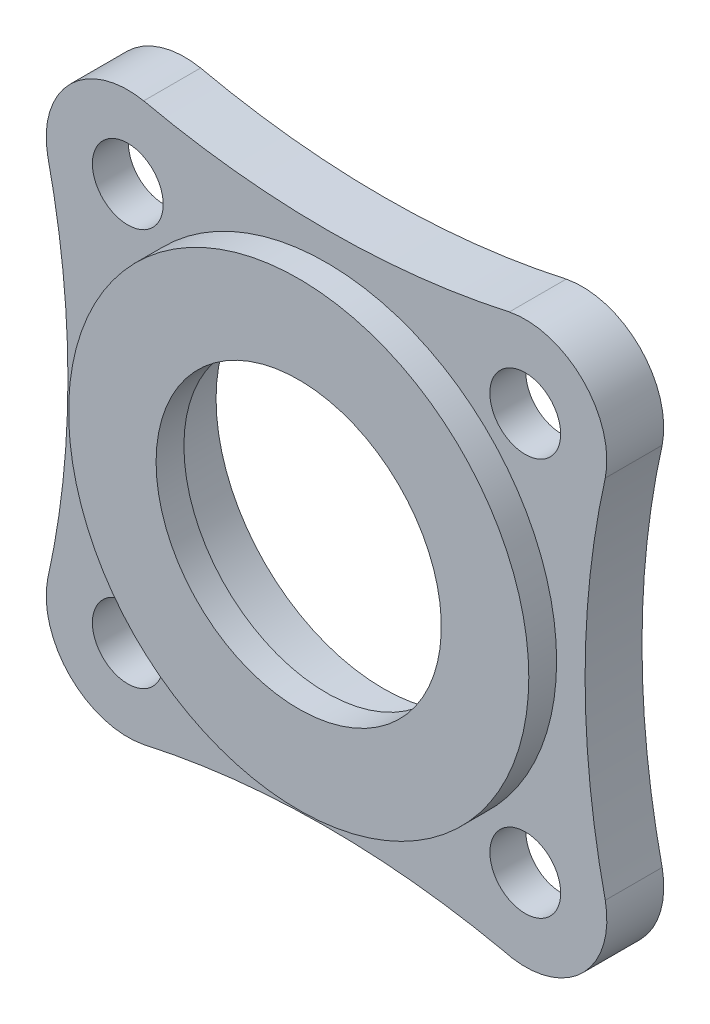
ISO-10303-21;
HEADER;
FILE_DESCRIPTION(('STEP AP214'),'2;1');
FILE_NAME('part.step','',(''),(''),'','','');
FILE_SCHEMA(('AUTOMOTIVE_DESIGN { 1 0 10303 214 1 1 1 1 }'));
ENDSEC;
DATA;
#1=APPLICATION_CONTEXT('core data for automotive mechanical design processes');
#2=APPLICATION_PROTOCOL_DEFINITION('international standard','automotive_design',2000,#1);
#3=PRODUCT_CONTEXT('',#1,'mechanical');
#4=PRODUCT('Part','Part','',(#3));
#5=PRODUCT_RELATED_PRODUCT_CATEGORY('part','',(#4));
#6=PRODUCT_DEFINITION_FORMATION('','',#4);
#7=PRODUCT_DEFINITION_CONTEXT('part definition',#1,'design');
#8=PRODUCT_DEFINITION('design','',#6,#7);
#9=PRODUCT_DEFINITION_SHAPE('','',#8);
#10=(LENGTH_UNIT() NAMED_UNIT(*) SI_UNIT(.MILLI.,.METRE.));
#11=(NAMED_UNIT(*) PLANE_ANGLE_UNIT() SI_UNIT($,.RADIAN.));
#12=(NAMED_UNIT(*) SI_UNIT($,.STERADIAN.) SOLID_ANGLE_UNIT());
#13=UNCERTAINTY_MEASURE_WITH_UNIT(LENGTH_MEASURE(1.E-05),#10,'distance_accuracy_value','');
#14=(GEOMETRIC_REPRESENTATION_CONTEXT(3) GLOBAL_UNCERTAINTY_ASSIGNED_CONTEXT((#13)) GLOBAL_UNIT_ASSIGNED_CONTEXT((#10,
#11,#12)) REPRESENTATION_CONTEXT('',''));
#15=CARTESIAN_POINT('',(0.,0.,0.));
#16=DIRECTION('',(0.,0.,1.));
#17=DIRECTION('',(1.,0.,0.));
#18=AXIS2_PLACEMENT_3D('',#15,#16,#17);
#19=CARTESIAN_POINT('',(18.9999780967866,19.0000219031894,5.44));
#20=DIRECTION('',(0.,0.,-1.));
#21=DIRECTION('',(-1.,0.,0.));
#22=AXIS2_PLACEMENT_3D('',#19,#20,#21);
#23=CYLINDRICAL_SURFACE('',#22,3.385);
#24=CARTESIAN_POINT('',(18.9999780967866,19.0000219031894,5.44));
#25=DIRECTION('',(0.,0.,1.));
#26=DIRECTION('',(1.,0.,0.));
#27=AXIS2_PLACEMENT_3D('',#24,#25,#26);
#28=CIRCLE('',#27,3.385);
#29=CARTESIAN_POINT('',(22.3849780967866,19.0000219031894,5.44));
#30=VERTEX_POINT('',#29);
#31=EDGE_CURVE('E146',#30,#30,#28,.T.);
#32=ORIENTED_EDGE('',*,*,#31,.T.);
#33=EDGE_LOOP('',(#32));
#34=FACE_BOUND('',#33,.T.);
#35=CARTESIAN_POINT('',(18.9999780967866,19.0000219031894,2.));
#36=DIRECTION('',(0.,0.,-1.));
#37=DIRECTION('',(-1.,0.,0.));
#38=AXIS2_PLACEMENT_3D('',#35,#36,#37);
#39=CIRCLE('',#38,3.385);
#40=CARTESIAN_POINT('',(15.6149780967866,19.0000219031894,2.));
#41=VERTEX_POINT('',#40);
#42=EDGE_CURVE('E43',#41,#41,#39,.T.);
#43=ORIENTED_EDGE('',*,*,#42,.T.);
#44=EDGE_LOOP('',(#43));
#45=FACE_BOUND('',#44,.T.);
#46=ADVANCED_FACE('F39',(#34,#45),#23,.F.);
#47=CARTESIAN_POINT('',(-19.0000219031881,18.9999780967864,5.44));
#48=DIRECTION('',(0.,0.,-1.));
#49=DIRECTION('',(-1.,0.,0.));
#50=AXIS2_PLACEMENT_3D('',#47,#48,#49);
#51=CYLINDRICAL_SURFACE('',#50,3.385);
#52=CARTESIAN_POINT('',(-19.0000219031881,18.9999780967864,5.44));
#53=DIRECTION('',(0.,0.,1.));
#54=DIRECTION('',(1.,0.,0.));
#55=AXIS2_PLACEMENT_3D('',#52,#53,#54);
#56=CIRCLE('',#55,3.385);
#57=CARTESIAN_POINT('',(-15.6150219031881,18.9999780967864,5.44));
#58=VERTEX_POINT('',#57);
#59=EDGE_CURVE('E143',#58,#58,#56,.T.);
#60=ORIENTED_EDGE('',*,*,#59,.T.);
#61=EDGE_LOOP('',(#60));
#62=FACE_BOUND('',#61,.T.);
#63=CARTESIAN_POINT('',(-19.0000219031881,18.9999780967864,2.));
#64=DIRECTION('',(0.,0.,-1.));
#65=DIRECTION('',(-1.,0.,0.));
#66=AXIS2_PLACEMENT_3D('',#63,#64,#65);
#67=CIRCLE('',#66,3.385);
#68=CARTESIAN_POINT('',(-22.3850219031881,18.9999780967864,2.));
#69=VERTEX_POINT('',#68);
#70=EDGE_CURVE('E194',#69,#69,#67,.T.);
#71=ORIENTED_EDGE('',*,*,#70,.T.);
#72=EDGE_LOOP('',(#71));
#73=FACE_BOUND('',#72,.T.);
#74=ADVANCED_FACE('F256',(#62,#73),#51,.F.);
#75=CARTESIAN_POINT('',(-18.9999780967851,-19.0000219031884,5.44));
#76=DIRECTION('',(0.,0.,-1.));
#77=DIRECTION('',(-1.,0.,0.));
#78=AXIS2_PLACEMENT_3D('',#75,#76,#77);
#79=CYLINDRICAL_SURFACE('',#78,3.385);
#80=CARTESIAN_POINT('',(-18.9999780967851,-19.0000219031884,5.44));
#81=DIRECTION('',(0.,0.,1.));
#82=DIRECTION('',(1.,0.,0.));
#83=AXIS2_PLACEMENT_3D('',#80,#81,#82);
#84=CIRCLE('',#83,3.385);
#85=CARTESIAN_POINT('',(-15.6149780967851,-19.0000219031884,5.44));
#86=VERTEX_POINT('',#85);
#87=EDGE_CURVE('E140',#86,#86,#84,.T.);
#88=ORIENTED_EDGE('',*,*,#87,.T.);
#89=EDGE_LOOP('',(#88));
#90=FACE_BOUND('',#89,.T.);
#91=CARTESIAN_POINT('',(-18.9999780967851,-19.0000219031884,2.));
#92=DIRECTION('',(0.,0.,-1.));
#93=DIRECTION('',(-1.,0.,0.));
#94=AXIS2_PLACEMENT_3D('',#91,#92,#93);
#95=CIRCLE('',#94,3.385);
#96=CARTESIAN_POINT('',(-22.3849780967851,-19.0000219031884,2.));
#97=VERTEX_POINT('',#96);
#98=EDGE_CURVE('E191',#97,#97,#95,.T.);
#99=ORIENTED_EDGE('',*,*,#98,.T.);
#100=EDGE_LOOP('',(#99));
#101=FACE_BOUND('',#100,.T.);
#102=ADVANCED_FACE('F262',(#90,#101),#79,.F.);
#103=CARTESIAN_POINT('',(19.0035218007627,-19.0174586367365,5.44));
#104=DIRECTION('',(0.,0.,-1.));
#105=DIRECTION('',(-1.,0.,0.));
#106=AXIS2_PLACEMENT_3D('',#103,#104,#105);
#107=CYLINDRICAL_SURFACE('',#106,3.385);
#108=CARTESIAN_POINT('',(19.0035218007627,-19.0174586367365,5.44));
#109=DIRECTION('',(0.,0.,1.));
#110=DIRECTION('',(1.,0.,0.));
#111=AXIS2_PLACEMENT_3D('',#108,#109,#110);
#112=CIRCLE('',#111,3.385);
#113=CARTESIAN_POINT('',(22.3885218007627,-19.0174586367365,5.44));
#114=VERTEX_POINT('',#113);
#115=EDGE_CURVE('E134',#114,#114,#112,.T.);
#116=ORIENTED_EDGE('',*,*,#115,.T.);
#117=EDGE_LOOP('',(#116));
#118=FACE_BOUND('',#117,.T.);
#119=CARTESIAN_POINT('',(19.0035218007627,-19.0174586367365,2.));
#120=DIRECTION('',(0.,0.,-1.));
#121=DIRECTION('',(-1.,0.,0.));
#122=AXIS2_PLACEMENT_3D('',#119,#120,#121);
#123=CIRCLE('',#122,3.385);
#124=CARTESIAN_POINT('',(15.6185218007627,-19.0174586367365,2.));
#125=VERTEX_POINT('',#124);
#126=EDGE_CURVE('E188',#125,#125,#123,.T.);
#127=ORIENTED_EDGE('',*,*,#126,.T.);
#128=EDGE_LOOP('',(#127));
#129=FACE_BOUND('',#128,.T.);
#130=ADVANCED_FACE('F271',(#118,#129),#107,.F.);
#131=CARTESIAN_POINT('',(0.000213605920601893,-104.922401044392,5.44));
#132=DIRECTION('',(0.,0.,-1.));
#133=DIRECTION('',(-1.,0.,0.));
#134=AXIS2_PLACEMENT_3D('',#131,#132,#133);
#135=CYLINDRICAL_SURFACE('',#134,80.2);
#136=CARTESIAN_POINT('',(0.000213605920601893,-104.922401044392,0.));
#137=DIRECTION('',(0.,0.,1.));
#138=DIRECTION('',(1.,0.,0.));
#139=AXIS2_PLACEMENT_3D('',#136,#137,#138);
#140=CIRCLE('',#139,80.2);
#141=CARTESIAN_POINT('',(16.8250039112033,-26.5070554085841,0.));
#142=VERTEX_POINT('',#141);
#143=CARTESIAN_POINT('',(-17.4774192715566,-26.6499771072219,0.));
#144=VERTEX_POINT('',#143);
#145=EDGE_CURVE('E154',#142,#144,#140,.T.);
#146=ORIENTED_EDGE('',*,*,#145,.F.);
#147=DIRECTION('',(0.,0.,-1.));
#148=VECTOR('',#147,1.);
#149=CARTESIAN_POINT('',(16.8250039112033,-26.5070554085841,5.44));
#150=LINE('',#149,#148);
#151=CARTESIAN_POINT('',(16.8250039112033,-26.5070554085841,5.44));
#152=VERTEX_POINT('',#151);
#153=EDGE_CURVE('E49',#152,#142,#150,.T.);
#154=ORIENTED_EDGE('',*,*,#153,.F.);
#155=CARTESIAN_POINT('',(0.000213605920601893,-104.922401044392,5.44));
#156=DIRECTION('',(0.,0.,1.));
#157=DIRECTION('',(1.,0.,0.));
#158=AXIS2_PLACEMENT_3D('',#155,#156,#157);
#159=CIRCLE('',#158,80.2);
#160=CARTESIAN_POINT('',(-17.4774192715566,-26.6499771072219,5.44));
#161=VERTEX_POINT('',#160);
#162=EDGE_CURVE('E177',#152,#161,#159,.T.);
#163=ORIENTED_EDGE('',*,*,#162,.T.);
#164=DIRECTION('',(0.,0.,-1.));
#165=VECTOR('',#164,1.);
#166=CARTESIAN_POINT('',(-17.4774192715566,-26.6499771072219,5.44));
#167=LINE('',#166,#165);
#168=EDGE_CURVE('E93',#161,#144,#167,.T.);
#169=ORIENTED_EDGE('',*,*,#168,.T.);
#170=EDGE_LOOP('',(#146,#154,#163,#169));
#171=FACE_BOUND('',#170,.T.);
#172=ADVANCED_FACE('F41',(#171),#135,.F.);
#173=CARTESIAN_POINT('',(19.0035218007627,-19.0174586367365,5.44));
#174=DIRECTION('',(0.,0.,-1.));
#175=DIRECTION('',(-1.,0.,0.));
#176=AXIS2_PLACEMENT_3D('',#173,#174,#175);
#177=CYLINDRICAL_SURFACE('',#176,7.8);
#178=CARTESIAN_POINT('',(19.0035218007627,-19.0174586367365,0.));
#179=DIRECTION('',(0.,0.,1.));
#180=DIRECTION('',(1.,0.,0.));
#181=AXIS2_PLACEMENT_3D('',#178,#179,#180);
#182=CIRCLE('',#181,7.8);
#183=CARTESIAN_POINT('',(26.6499771072231,-17.477419271557,0.));
#184=VERTEX_POINT('',#183);
#185=EDGE_CURVE('E157',#142,#184,#182,.T.);
#186=ORIENTED_EDGE('',*,*,#185,.T.);
#187=DIRECTION('',(0.,0.,-1.));
#188=VECTOR('',#187,1.);
#189=CARTESIAN_POINT('',(26.6499771072231,-17.477419271557,5.44));
#190=LINE('',#189,#188);
#191=CARTESIAN_POINT('',(26.6499771072231,-17.477419271557,5.44));
#192=VERTEX_POINT('',#191);
#193=EDGE_CURVE('E185',#192,#184,#190,.T.);
#194=ORIENTED_EDGE('',*,*,#193,.F.);
#195=CARTESIAN_POINT('',(19.0035218007627,-19.0174586367365,5.44));
#196=DIRECTION('',(0.,0.,1.));
#197=DIRECTION('',(1.,0.,0.));
#198=AXIS2_PLACEMENT_3D('',#195,#196,#197);
#199=CIRCLE('',#198,7.8);
#200=EDGE_CURVE('E221',#152,#192,#199,.T.);
#201=ORIENTED_EDGE('',*,*,#200,.F.);
#202=ORIENTED_EDGE('',*,*,#153,.T.);
#203=EDGE_LOOP('',(#186,#194,#201,#202));
#204=FACE_BOUND('',#203,.T.);
#205=ADVANCED_FACE('F240',(#204),#177,.T.);
#206=CARTESIAN_POINT('',(104.922401044394,0.000213605920345668,5.44));
#207=DIRECTION('',(0.,0.,-1.));
#208=DIRECTION('',(-1.,0.,0.));
#209=AXIS2_PLACEMENT_3D('',#206,#207,#208);
#210=CYLINDRICAL_SURFACE('',#209,80.2);
#211=CARTESIAN_POINT('',(104.922401044394,0.000213605920345668,0.));
#212=DIRECTION('',(0.,0.,1.));
#213=DIRECTION('',(1.,0.,0.));
#214=AXIS2_PLACEMENT_3D('',#211,#212,#213);
#215=CIRCLE('',#214,80.2);
#216=CARTESIAN_POINT('',(26.6502742791419,17.4791772950063,0.));
#217=VERTEX_POINT('',#216);
#218=EDGE_CURVE('E160',#217,#184,#215,.T.);
#219=ORIENTED_EDGE('',*,*,#218,.F.);
#220=DIRECTION('',(0.,0.,-1.));
#221=VECTOR('',#220,1.);
#222=CARTESIAN_POINT('',(26.6502742791419,17.4791772950063,5.44));
#223=LINE('',#222,#221);
#224=CARTESIAN_POINT('',(26.6502742791419,17.4791772950063,5.44));
#225=VERTEX_POINT('',#224);
#226=EDGE_CURVE('E183',#225,#217,#223,.T.);
#227=ORIENTED_EDGE('',*,*,#226,.F.);
#228=CARTESIAN_POINT('',(104.922401044394,0.000213605920345668,5.44));
#229=DIRECTION('',(0.,0.,1.));
#230=DIRECTION('',(1.,0.,0.));
#231=AXIS2_PLACEMENT_3D('',#228,#229,#230);
#232=CIRCLE('',#231,80.2);
#233=EDGE_CURVE('E223',#225,#192,#232,.T.);
#234=ORIENTED_EDGE('',*,*,#233,.T.);
#235=ORIENTED_EDGE('',*,*,#193,.T.);
#236=EDGE_LOOP('',(#219,#227,#234,#235));
#237=FACE_BOUND('',#236,.T.);
#238=ADVANCED_FACE('F243',(#237),#210,.F.);
#239=CARTESIAN_POINT('',(18.9999780967866,19.0000219031894,5.44));
#240=DIRECTION('',(0.,0.,-1.));
#241=DIRECTION('',(-1.,0.,0.));
#242=AXIS2_PLACEMENT_3D('',#239,#240,#241);
#243=CYLINDRICAL_SURFACE('',#242,7.8);
#244=CARTESIAN_POINT('',(18.9999780967866,19.0000219031894,0.));
#245=DIRECTION('',(0.,0.,1.));
#246=DIRECTION('',(1.,0.,0.));
#247=AXIS2_PLACEMENT_3D('',#244,#245,#246);
#248=CIRCLE('',#247,7.8);
#249=CARTESIAN_POINT('',(17.4774192715582,26.6499771072229,0.));
#250=VERTEX_POINT('',#249);
#251=EDGE_CURVE('E163',#217,#250,#248,.T.);
#252=ORIENTED_EDGE('',*,*,#251,.T.);
#253=DIRECTION('',(0.,0.,-1.));
#254=VECTOR('',#253,1.);
#255=CARTESIAN_POINT('',(17.4774192715582,26.6499771072229,5.44));
#256=LINE('',#255,#254);
#257=CARTESIAN_POINT('',(17.4774192715582,26.6499771072229,5.44));
#258=VERTEX_POINT('',#257);
#259=EDGE_CURVE('E181',#258,#250,#256,.T.);
#260=ORIENTED_EDGE('',*,*,#259,.F.);
#261=CARTESIAN_POINT('',(18.9999780967866,19.0000219031894,5.44));
#262=DIRECTION('',(0.,0.,1.));
#263=DIRECTION('',(1.,0.,0.));
#264=AXIS2_PLACEMENT_3D('',#261,#262,#263);
#265=CIRCLE('',#264,7.8);
#266=EDGE_CURVE('E226',#225,#258,#265,.T.);
#267=ORIENTED_EDGE('',*,*,#266,.F.);
#268=ORIENTED_EDGE('',*,*,#226,.T.);
#269=EDGE_LOOP('',(#252,#260,#267,#268));
#270=FACE_BOUND('',#269,.T.);
#271=ADVANCED_FACE('F246',(#270),#243,.T.);
#272=CARTESIAN_POINT('',(-0.000213605919076365,104.922401044393,5.44));
#273=DIRECTION('',(0.,0.,-1.));
#274=DIRECTION('',(-1.,0.,0.));
#275=AXIS2_PLACEMENT_3D('',#272,#273,#274);
#276=CYLINDRICAL_SURFACE('',#275,80.2);
#277=CARTESIAN_POINT('',(-0.000213605919076365,104.922401044393,0.));
#278=DIRECTION('',(0.,0.,1.));
#279=DIRECTION('',(1.,0.,0.));
#280=AXIS2_PLACEMENT_3D('',#277,#278,#279);
#281=CIRCLE('',#280,80.2);
#282=CARTESIAN_POINT('',(-17.4791772950052,26.6502742791417,0.));
#283=VERTEX_POINT('',#282);
#284=EDGE_CURVE('E166',#283,#250,#281,.T.);
#285=ORIENTED_EDGE('',*,*,#284,.F.);
#286=DIRECTION('',(0.,0.,-1.));
#287=VECTOR('',#286,1.);
#288=CARTESIAN_POINT('',(-17.4791772950052,26.6502742791417,5.44));
#289=LINE('',#288,#287);
#290=CARTESIAN_POINT('',(-17.4791772950052,26.6502742791417,5.44));
#291=VERTEX_POINT('',#290);
#292=EDGE_CURVE('E130',#291,#283,#289,.T.);
#293=ORIENTED_EDGE('',*,*,#292,.F.);
#294=CARTESIAN_POINT('',(-0.000213605919076365,104.922401044393,5.44));
#295=DIRECTION('',(0.,0.,1.));
#296=DIRECTION('',(1.,0.,0.));
#297=AXIS2_PLACEMENT_3D('',#294,#295,#296);
#298=CIRCLE('',#297,80.2);
#299=EDGE_CURVE('E119',#291,#258,#298,.T.);
#300=ORIENTED_EDGE('',*,*,#299,.T.);
#301=ORIENTED_EDGE('',*,*,#259,.T.);
#302=EDGE_LOOP('',(#285,#293,#300,#301));
#303=FACE_BOUND('',#302,.T.);
#304=ADVANCED_FACE('F229',(#303),#276,.F.);
#305=CARTESIAN_POINT('',(-19.0000219031881,18.9999780967864,5.44));
#306=DIRECTION('',(0.,0.,-1.));
#307=DIRECTION('',(-1.,0.,0.));
#308=AXIS2_PLACEMENT_3D('',#305,#306,#307);
#309=CYLINDRICAL_SURFACE('',#308,7.8);
#310=CARTESIAN_POINT('',(-19.0000219031881,18.9999780967864,0.));
#311=DIRECTION('',(0.,0.,1.));
#312=DIRECTION('',(1.,0.,0.));
#313=AXIS2_PLACEMENT_3D('',#310,#311,#312);
#314=CIRCLE('',#313,7.8);
#315=CARTESIAN_POINT('',(-26.6499771072216,17.477419271558,0.));
#316=VERTEX_POINT('',#315);
#317=EDGE_CURVE('E126',#283,#316,#314,.T.);
#318=ORIENTED_EDGE('',*,*,#317,.T.);
#319=DIRECTION('',(0.,0.,-1.));
#320=VECTOR('',#319,1.);
#321=CARTESIAN_POINT('',(-26.6499771072216,17.477419271558,5.44));
#322=LINE('',#321,#320);
#323=CARTESIAN_POINT('',(-26.6499771072216,17.477419271558,5.44));
#324=VERTEX_POINT('',#323);
#325=EDGE_CURVE('E123',#324,#316,#322,.T.);
#326=ORIENTED_EDGE('',*,*,#325,.F.);
#327=CARTESIAN_POINT('',(-19.0000219031881,18.9999780967864,5.44));
#328=DIRECTION('',(0.,0.,1.));
#329=DIRECTION('',(1.,0.,0.));
#330=AXIS2_PLACEMENT_3D('',#327,#328,#329);
#331=CIRCLE('',#330,7.8);
#332=EDGE_CURVE('E112',#291,#324,#331,.T.);
#333=ORIENTED_EDGE('',*,*,#332,.F.);
#334=ORIENTED_EDGE('',*,*,#292,.T.);
#335=EDGE_LOOP('',(#318,#326,#333,#334));
#336=FACE_BOUND('',#335,.T.);
#337=ADVANCED_FACE('F124',(#336),#309,.T.);
#338=CARTESIAN_POINT('',(-104.922401044392,-0.000213605919345439,5.44));
#339=DIRECTION('',(0.,0.,-1.));
#340=DIRECTION('',(-1.,0.,0.));
#341=AXIS2_PLACEMENT_3D('',#338,#339,#340);
#342=CYLINDRICAL_SURFACE('',#341,80.2);
#343=CARTESIAN_POINT('',(-104.922401044392,-0.000213605919345439,0.));
#344=DIRECTION('',(0.,0.,1.));
#345=DIRECTION('',(1.,0.,0.));
#346=AXIS2_PLACEMENT_3D('',#343,#344,#345);
#347=CIRCLE('',#346,80.2);
#348=CARTESIAN_POINT('',(-26.6502742791404,-17.4791772950053,0.));
#349=VERTEX_POINT('',#348);
#350=EDGE_CURVE('E170',#349,#316,#347,.T.);
#351=ORIENTED_EDGE('',*,*,#350,.F.);
#352=DIRECTION('',(0.,0.,-1.));
#353=VECTOR('',#352,1.);
#354=CARTESIAN_POINT('',(-26.6502742791404,-17.4791772950053,5.44));
#355=LINE('',#354,#353);
#356=CARTESIAN_POINT('',(-26.6502742791404,-17.4791772950053,5.44));
#357=VERTEX_POINT('',#356);
#358=EDGE_CURVE('E86',#357,#349,#355,.T.);
#359=ORIENTED_EDGE('',*,*,#358,.F.);
#360=CARTESIAN_POINT('',(-104.922401044392,-0.000213605919345439,5.44));
#361=DIRECTION('',(0.,0.,1.));
#362=DIRECTION('',(1.,0.,0.));
#363=AXIS2_PLACEMENT_3D('',#360,#361,#362);
#364=CIRCLE('',#363,80.2);
#365=EDGE_CURVE('E117',#357,#324,#364,.T.);
#366=ORIENTED_EDGE('',*,*,#365,.T.);
#367=ORIENTED_EDGE('',*,*,#325,.T.);
#368=EDGE_LOOP('',(#351,#359,#366,#367));
#369=FACE_BOUND('',#368,.T.);
#370=ADVANCED_FACE('F132',(#369),#342,.F.);
#371=CARTESIAN_POINT('',(-18.9999780967851,-19.0000219031884,5.44));
#372=DIRECTION('',(0.,0.,-1.));
#373=DIRECTION('',(-1.,0.,0.));
#374=AXIS2_PLACEMENT_3D('',#371,#372,#373);
#375=CYLINDRICAL_SURFACE('',#374,7.8);
#376=CARTESIAN_POINT('',(-18.9999780967851,-19.0000219031884,0.));
#377=DIRECTION('',(0.,0.,1.));
#378=DIRECTION('',(1.,0.,0.));
#379=AXIS2_PLACEMENT_3D('',#376,#377,#378);
#380=CIRCLE('',#379,7.8);
#381=EDGE_CURVE('E172',#349,#144,#380,.T.);
#382=ORIENTED_EDGE('',*,*,#381,.T.);
#383=ORIENTED_EDGE('',*,*,#168,.F.);
#384=CARTESIAN_POINT('',(-18.9999780967851,-19.0000219031884,5.44));
#385=DIRECTION('',(0.,0.,1.));
#386=DIRECTION('',(1.,0.,0.));
#387=AXIS2_PLACEMENT_3D('',#384,#385,#386);
#388=CIRCLE('',#387,7.8);
#389=EDGE_CURVE('E58',#357,#161,#388,.T.);
#390=ORIENTED_EDGE('',*,*,#389,.F.);
#391=ORIENTED_EDGE('',*,*,#358,.T.);
#392=EDGE_LOOP('',(#382,#383,#390,#391));
#393=FACE_BOUND('',#392,.T.);
#394=ADVANCED_FACE('F236',(#393),#375,.T.);
#395=CARTESIAN_POINT('',(0.,0.,5.44));
#396=DIRECTION('',(0.,0.,-1.));
#397=DIRECTION('',(-1.,0.,0.));
#398=AXIS2_PLACEMENT_3D('',#395,#396,#397);
#399=CYLINDRICAL_SURFACE('',#398,16.);
#400=CARTESIAN_POINT('',(0.,0.,5.44));
#401=DIRECTION('',(0.,0.,1.));
#402=DIRECTION('',(1.,0.,0.));
#403=AXIS2_PLACEMENT_3D('',#400,#401,#402);
#404=CIRCLE('',#403,16.);
#405=CARTESIAN_POINT('',(16.,0.,5.44));
#406=VERTEX_POINT('',#405);
#407=EDGE_CURVE('E149',#406,#406,#404,.T.);
#408=ORIENTED_EDGE('',*,*,#407,.T.);
#409=EDGE_LOOP('',(#408));
#410=FACE_BOUND('',#409,.T.);
#411=CARTESIAN_POINT('',(0.,0.,0.));
#412=DIRECTION('',(0.,0.,1.));
#413=DIRECTION('',(1.,0.,0.));
#414=AXIS2_PLACEMENT_3D('',#411,#412,#413);
#415=CIRCLE('',#414,16.);
#416=CARTESIAN_POINT('',(16.,0.,0.));
#417=VERTEX_POINT('',#416);
#418=EDGE_CURVE('E174',#417,#417,#415,.T.);
#419=ORIENTED_EDGE('',*,*,#418,.F.);
#420=EDGE_LOOP('',(#419));
#421=FACE_BOUND('',#420,.T.);
#422=ADVANCED_FACE('F266',(#410,#421),#399,.F.);
#423=CARTESIAN_POINT('',(0.,0.,5.44));
#424=DIRECTION('',(0.,0.,1.));
#425=DIRECTION('',(1.,0.,0.));
#426=AXIS2_PLACEMENT_3D('',#423,#424,#425);
#427=PLANE('',#426);
#428=CARTESIAN_POINT('',(0.,0.,5.44));
#429=DIRECTION('',(0.,0.,1.));
#430=DIRECTION('',(1.,0.,0.));
#431=AXIS2_PLACEMENT_3D('',#428,#429,#430);
#432=CIRCLE('',#431,22.);
#433=CARTESIAN_POINT('',(22.,0.,5.44));
#434=VERTEX_POINT('',#433);
#435=EDGE_CURVE('E11',#434,#434,#432,.T.);
#436=ORIENTED_EDGE('',*,*,#435,.F.);
#437=EDGE_LOOP('',(#436));
#438=FACE_BOUND('',#437,.T.);
#439=ORIENTED_EDGE('',*,*,#162,.F.);
#440=ORIENTED_EDGE('',*,*,#200,.T.);
#441=ORIENTED_EDGE('',*,*,#233,.F.);
#442=ORIENTED_EDGE('',*,*,#266,.T.);
#443=ORIENTED_EDGE('',*,*,#299,.F.);
#444=ORIENTED_EDGE('',*,*,#332,.T.);
#445=ORIENTED_EDGE('',*,*,#365,.F.);
#446=ORIENTED_EDGE('',*,*,#389,.T.);
#447=EDGE_LOOP('',(#439,#440,#441,#442,#443,#444,#445,#446));
#448=FACE_BOUND('',#447,.T.);
#449=ORIENTED_EDGE('',*,*,#115,.F.);
#450=EDGE_LOOP('',(#449));
#451=FACE_BOUND('',#450,.T.);
#452=ORIENTED_EDGE('',*,*,#87,.F.);
#453=EDGE_LOOP('',(#452));
#454=FACE_BOUND('',#453,.T.);
#455=ORIENTED_EDGE('',*,*,#59,.F.);
#456=EDGE_LOOP('',(#455));
#457=FACE_BOUND('',#456,.T.);
#458=ORIENTED_EDGE('',*,*,#31,.F.);
#459=EDGE_LOOP('',(#458));
#460=FACE_BOUND('',#459,.T.);
#461=ADVANCED_FACE('F114',(#438,#448,#451,#454,#457,#460),#427,.T.);
#462=CARTESIAN_POINT('',(0.,0.,0.));
#463=DIRECTION('',(0.,0.,1.));
#464=DIRECTION('',(1.,0.,0.));
#465=AXIS2_PLACEMENT_3D('',#462,#463,#464);
#466=PLANE('',#465);
#467=CARTESIAN_POINT('',(-19.0000219031881,18.9999780967864,0.));
#468=DIRECTION('',(0.,0.,-1.));
#469=DIRECTION('',(-1.,0.,0.));
#470=AXIS2_PLACEMENT_3D('',#467,#468,#469);
#471=CIRCLE('',#470,6.5);
#472=CARTESIAN_POINT('',(-25.5000219031881,18.9999780967864,0.));
#473=VERTEX_POINT('',#472);
#474=EDGE_CURVE('E214',#473,#473,#471,.T.);
#475=ORIENTED_EDGE('',*,*,#474,.F.);
#476=EDGE_LOOP('',(#475));
#477=FACE_BOUND('',#476,.T.);
#478=CARTESIAN_POINT('',(19.0035218007627,-19.0174586367365,0.));
#479=DIRECTION('',(0.,0.,-1.));
#480=DIRECTION('',(-1.,0.,0.));
#481=AXIS2_PLACEMENT_3D('',#478,#479,#480);
#482=CIRCLE('',#481,6.5);
#483=CARTESIAN_POINT('',(12.5035218007627,-19.0174586367365,0.));
#484=VERTEX_POINT('',#483);
#485=EDGE_CURVE('E519',#484,#484,#482,.T.);
#486=ORIENTED_EDGE('',*,*,#485,.F.);
#487=EDGE_LOOP('',(#486));
#488=FACE_BOUND('',#487,.T.);
#489=CARTESIAN_POINT('',(-18.9999780967851,-19.0000219031884,0.));
#490=DIRECTION('',(0.,0.,-1.));
#491=DIRECTION('',(-1.,0.,0.));
#492=AXIS2_PLACEMENT_3D('',#489,#490,#491);
#493=CIRCLE('',#492,6.5);
#494=CARTESIAN_POINT('',(-25.4999780967851,-19.0000219031884,0.));
#495=VERTEX_POINT('',#494);
#496=EDGE_CURVE('E510',#495,#495,#493,.T.);
#497=ORIENTED_EDGE('',*,*,#496,.F.);
#498=EDGE_LOOP('',(#497));
#499=FACE_BOUND('',#498,.T.);
#500=CARTESIAN_POINT('',(18.9999780967866,19.0000219031894,0.));
#501=DIRECTION('',(0.,0.,-1.));
#502=DIRECTION('',(-1.,0.,0.));
#503=AXIS2_PLACEMENT_3D('',#500,#501,#502);
#504=CIRCLE('',#503,6.5);
#505=CARTESIAN_POINT('',(12.4999780967866,19.0000219031894,0.));
#506=VERTEX_POINT('',#505);
#507=EDGE_CURVE('E211',#506,#506,#504,.T.);
#508=ORIENTED_EDGE('',*,*,#507,.F.);
#509=EDGE_LOOP('',(#508));
#510=FACE_BOUND('',#509,.T.);
#511=ORIENTED_EDGE('',*,*,#145,.T.);
#512=ORIENTED_EDGE('',*,*,#381,.F.);
#513=ORIENTED_EDGE('',*,*,#350,.T.);
#514=ORIENTED_EDGE('',*,*,#317,.F.);
#515=ORIENTED_EDGE('',*,*,#284,.T.);
#516=ORIENTED_EDGE('',*,*,#251,.F.);
#517=ORIENTED_EDGE('',*,*,#218,.T.);
#518=ORIENTED_EDGE('',*,*,#185,.F.);
#519=EDGE_LOOP('',(#511,#512,#513,#514,#515,#516,#517,#518));
#520=FACE_BOUND('',#519,.T.);
#521=ORIENTED_EDGE('',*,*,#418,.T.);
#522=EDGE_LOOP('',(#521));
#523=FACE_BOUND('',#522,.T.);
#524=ADVANCED_FACE('F232',(#477,#488,#499,#510,#520,#523),#466,.F.);
#525=CARTESIAN_POINT('',(18.9999780967866,19.0000219031894,2.));
#526=DIRECTION('',(0.,0.,-1.));
#527=DIRECTION('',(-1.,0.,0.));
#528=AXIS2_PLACEMENT_3D('',#525,#526,#527);
#529=CYLINDRICAL_SURFACE('',#528,6.5);
#530=CARTESIAN_POINT('',(18.9999780967866,19.0000219031894,2.));
#531=DIRECTION('',(0.,0.,-1.));
#532=DIRECTION('',(-1.,0.,0.));
#533=AXIS2_PLACEMENT_3D('',#530,#531,#532);
#534=CIRCLE('',#533,6.5);
#535=CARTESIAN_POINT('',(12.4999780967866,19.0000219031894,2.));
#536=VERTEX_POINT('',#535);
#537=EDGE_CURVE('E192',#536,#536,#534,.T.);
#538=ORIENTED_EDGE('',*,*,#537,.F.);
#539=EDGE_LOOP('',(#538));
#540=FACE_BOUND('',#539,.T.);
#541=ORIENTED_EDGE('',*,*,#507,.T.);
#542=EDGE_LOOP('',(#541));
#543=FACE_BOUND('',#542,.T.);
#544=ADVANCED_FACE('F206',(#540,#543),#529,.F.);
#545=CARTESIAN_POINT('',(18.9999780967866,19.0000219031894,2.));
#546=DIRECTION('',(0.,0.,-1.));
#547=DIRECTION('',(-1.,0.,0.));
#548=AXIS2_PLACEMENT_3D('',#545,#546,#547);
#549=PLANE('',#548);
#550=ORIENTED_EDGE('',*,*,#42,.F.);
#551=EDGE_LOOP('',(#550));
#552=FACE_BOUND('',#551,.T.);
#553=ORIENTED_EDGE('',*,*,#537,.T.);
#554=EDGE_LOOP('',(#553));
#555=FACE_BOUND('',#554,.T.);
#556=ADVANCED_FACE('F202',(#552,#555),#549,.T.);
#557=CARTESIAN_POINT('',(-18.9999780967851,-19.0000219031884,2.));
#558=DIRECTION('',(0.,0.,-1.));
#559=DIRECTION('',(-1.,0.,0.));
#560=AXIS2_PLACEMENT_3D('',#557,#558,#559);
#561=CYLINDRICAL_SURFACE('',#560,6.5);
#562=CARTESIAN_POINT('',(-18.9999780967851,-19.0000219031884,2.));
#563=DIRECTION('',(0.,0.,-1.));
#564=DIRECTION('',(-1.,0.,0.));
#565=AXIS2_PLACEMENT_3D('',#562,#563,#564);
#566=CIRCLE('',#565,6.5);
#567=CARTESIAN_POINT('',(-25.4999780967851,-19.0000219031884,2.));
#568=VERTEX_POINT('',#567);
#569=EDGE_CURVE('E152',#568,#568,#566,.T.);
#570=ORIENTED_EDGE('',*,*,#569,.F.);
#571=EDGE_LOOP('',(#570));
#572=FACE_BOUND('',#571,.T.);
#573=ORIENTED_EDGE('',*,*,#496,.T.);
#574=EDGE_LOOP('',(#573));
#575=FACE_BOUND('',#574,.T.);
#576=ADVANCED_FACE('F205',(#572,#575),#561,.F.);
#577=CARTESIAN_POINT('',(-18.9999780967851,-19.0000219031884,2.));
#578=DIRECTION('',(0.,0.,-1.));
#579=DIRECTION('',(-1.,0.,0.));
#580=AXIS2_PLACEMENT_3D('',#577,#578,#579);
#581=PLANE('',#580);
#582=ORIENTED_EDGE('',*,*,#98,.F.);
#583=EDGE_LOOP('',(#582));
#584=FACE_BOUND('',#583,.T.);
#585=ORIENTED_EDGE('',*,*,#569,.T.);
#586=EDGE_LOOP('',(#585));
#587=FACE_BOUND('',#586,.T.);
#588=ADVANCED_FACE('F331',(#584,#587),#581,.T.);
#589=CARTESIAN_POINT('',(19.0035218007627,-19.0174586367365,2.));
#590=DIRECTION('',(0.,0.,-1.));
#591=DIRECTION('',(-1.,0.,0.));
#592=AXIS2_PLACEMENT_3D('',#589,#590,#591);
#593=CYLINDRICAL_SURFACE('',#592,6.5);
#594=CARTESIAN_POINT('',(19.0035218007627,-19.0174586367365,2.));
#595=DIRECTION('',(0.,0.,-1.));
#596=DIRECTION('',(-1.,0.,0.));
#597=AXIS2_PLACEMENT_3D('',#594,#595,#596);
#598=CIRCLE('',#597,6.5);
#599=CARTESIAN_POINT('',(12.5035218007627,-19.0174586367365,2.));
#600=VERTEX_POINT('',#599);
#601=EDGE_CURVE('E217',#600,#600,#598,.T.);
#602=ORIENTED_EDGE('',*,*,#601,.F.);
#603=EDGE_LOOP('',(#602));
#604=FACE_BOUND('',#603,.T.);
#605=ORIENTED_EDGE('',*,*,#485,.T.);
#606=EDGE_LOOP('',(#605));
#607=FACE_BOUND('',#606,.T.);
#608=ADVANCED_FACE('F339',(#604,#607),#593,.F.);
#609=CARTESIAN_POINT('',(19.0035218007627,-19.0174586367365,2.));
#610=DIRECTION('',(0.,0.,-1.));
#611=DIRECTION('',(-1.,0.,0.));
#612=AXIS2_PLACEMENT_3D('',#609,#610,#611);
#613=PLANE('',#612);
#614=ORIENTED_EDGE('',*,*,#126,.F.);
#615=EDGE_LOOP('',(#614));
#616=FACE_BOUND('',#615,.T.);
#617=ORIENTED_EDGE('',*,*,#601,.T.);
#618=EDGE_LOOP('',(#617));
#619=FACE_BOUND('',#618,.T.);
#620=ADVANCED_FACE('F347',(#616,#619),#613,.T.);
#621=CARTESIAN_POINT('',(-19.0000219031881,18.9999780967864,2.));
#622=DIRECTION('',(0.,0.,-1.));
#623=DIRECTION('',(-1.,0.,0.));
#624=AXIS2_PLACEMENT_3D('',#621,#622,#623);
#625=CYLINDRICAL_SURFACE('',#624,6.5);
#626=CARTESIAN_POINT('',(-19.0000219031881,18.9999780967864,2.));
#627=DIRECTION('',(0.,0.,-1.));
#628=DIRECTION('',(-1.,0.,0.));
#629=AXIS2_PLACEMENT_3D('',#626,#627,#628);
#630=CIRCLE('',#629,6.5);
#631=CARTESIAN_POINT('',(-25.5000219031881,18.9999780967864,2.));
#632=VERTEX_POINT('',#631);
#633=EDGE_CURVE('E517',#632,#632,#630,.T.);
#634=ORIENTED_EDGE('',*,*,#633,.F.);
#635=EDGE_LOOP('',(#634));
#636=FACE_BOUND('',#635,.T.);
#637=ORIENTED_EDGE('',*,*,#474,.T.);
#638=EDGE_LOOP('',(#637));
#639=FACE_BOUND('',#638,.T.);
#640=ADVANCED_FACE('F355',(#636,#639),#625,.F.);
#641=CARTESIAN_POINT('',(-19.0000219031881,18.9999780967864,2.));
#642=DIRECTION('',(0.,0.,-1.));
#643=DIRECTION('',(-1.,0.,0.));
#644=AXIS2_PLACEMENT_3D('',#641,#642,#643);
#645=PLANE('',#644);
#646=ORIENTED_EDGE('',*,*,#70,.F.);
#647=EDGE_LOOP('',(#646));
#648=FACE_BOUND('',#647,.T.);
#649=ORIENTED_EDGE('',*,*,#633,.T.);
#650=EDGE_LOOP('',(#649));
#651=FACE_BOUND('',#650,.T.);
#652=ADVANCED_FACE('F363',(#648,#651),#645,.T.);
#653=CARTESIAN_POINT('',(0.,0.,8.1));
#654=DIRECTION('',(0.,0.,1.));
#655=DIRECTION('',(1.,0.,0.));
#656=AXIS2_PLACEMENT_3D('',#653,#654,#655);
#657=PLANE('',#656);
#658=CARTESIAN_POINT('',(0.,0.,8.1));
#659=DIRECTION('',(0.,0.,-1.));
#660=DIRECTION('',(-1.,0.,0.));
#661=AXIS2_PLACEMENT_3D('',#658,#659,#660);
#662=CIRCLE('',#661,13.635);
#663=CARTESIAN_POINT('',(-13.635,0.,8.1));
#664=VERTEX_POINT('',#663);
#665=EDGE_CURVE('E501',#664,#664,#662,.T.);
#666=ORIENTED_EDGE('',*,*,#665,.T.);
#667=EDGE_LOOP('',(#666));
#668=FACE_BOUND('',#667,.T.);
#669=CARTESIAN_POINT('',(0.,0.,8.1));
#670=DIRECTION('',(0.,0.,1.));
#671=DIRECTION('',(1.,0.,0.));
#672=AXIS2_PLACEMENT_3D('',#669,#670,#671);
#673=CIRCLE('',#672,22.);
#674=CARTESIAN_POINT('',(22.,0.,8.1));
#675=VERTEX_POINT('',#674);
#676=EDGE_CURVE('E153',#675,#675,#673,.T.);
#677=ORIENTED_EDGE('',*,*,#676,.T.);
#678=EDGE_LOOP('',(#677));
#679=FACE_BOUND('',#678,.T.);
#680=ADVANCED_FACE('F370',(#668,#679),#657,.T.);
#681=CARTESIAN_POINT('',(0.,0.,8.1));
#682=DIRECTION('',(0.,0.,-1.));
#683=DIRECTION('',(-1.,0.,0.));
#684=AXIS2_PLACEMENT_3D('',#681,#682,#683);
#685=CYLINDRICAL_SURFACE('',#684,22.);
#686=ORIENTED_EDGE('',*,*,#676,.F.);
#687=EDGE_LOOP('',(#686));
#688=FACE_BOUND('',#687,.T.);
#689=ORIENTED_EDGE('',*,*,#435,.T.);
#690=EDGE_LOOP('',(#689));
#691=FACE_BOUND('',#690,.T.);
#692=ADVANCED_FACE('F378',(#688,#691),#685,.T.);
#693=CARTESIAN_POINT('',(0.,0.,5.44));
#694=DIRECTION('',(0.,0.,1.));
#695=DIRECTION('',(1.,0.,0.));
#696=AXIS2_PLACEMENT_3D('',#693,#694,#695);
#697=PLANE('',#696);
#698=CARTESIAN_POINT('',(0.,0.,5.44));
#699=DIRECTION('',(0.,0.,-1.));
#700=DIRECTION('',(-1.,0.,0.));
#701=AXIS2_PLACEMENT_3D('',#698,#699,#700);
#702=CIRCLE('',#701,13.635);
#703=CARTESIAN_POINT('',(-13.635,0.,5.44));
#704=VERTEX_POINT('',#703);
#705=EDGE_CURVE('E504',#704,#704,#702,.T.);
#706=ORIENTED_EDGE('',*,*,#705,.F.);
#707=EDGE_LOOP('',(#706));
#708=FACE_BOUND('',#707,.T.);
#709=ORIENTED_EDGE('',*,*,#407,.F.);
#710=EDGE_LOOP('',(#709));
#711=FACE_BOUND('',#710,.T.);
#712=ADVANCED_FACE('F386',(#708,#711),#697,.F.);
#713=CARTESIAN_POINT('',(0.,0.,8.1));
#714=DIRECTION('',(0.,0.,-1.));
#715=DIRECTION('',(-1.,0.,0.));
#716=AXIS2_PLACEMENT_3D('',#713,#714,#715);
#717=CYLINDRICAL_SURFACE('',#716,13.635);
#718=ORIENTED_EDGE('',*,*,#665,.F.);
#719=EDGE_LOOP('',(#718));
#720=FACE_BOUND('',#719,.T.);
#721=ORIENTED_EDGE('',*,*,#705,.T.);
#722=EDGE_LOOP('',(#721));
#723=FACE_BOUND('',#722,.T.);
#724=ADVANCED_FACE('F393',(#720,#723),#717,.F.);
#725=CLOSED_SHELL('',(#46,#74,#102,#130,#172,#205,#238,#271,#304,#337,#370,#394,#422,#461,#524,
#544,#556,#576,#588,#608,#620,#640,#652,#680,#692,#712,#724));
#726=MANIFOLD_SOLID_BREP('B2',#725);
#727=ADVANCED_BREP_SHAPE_REPRESENTATION('',(#18,#726),#14);
#728=SHAPE_DEFINITION_REPRESENTATION(#9,#727);
ENDSEC;
END-ISO-10303-21;
